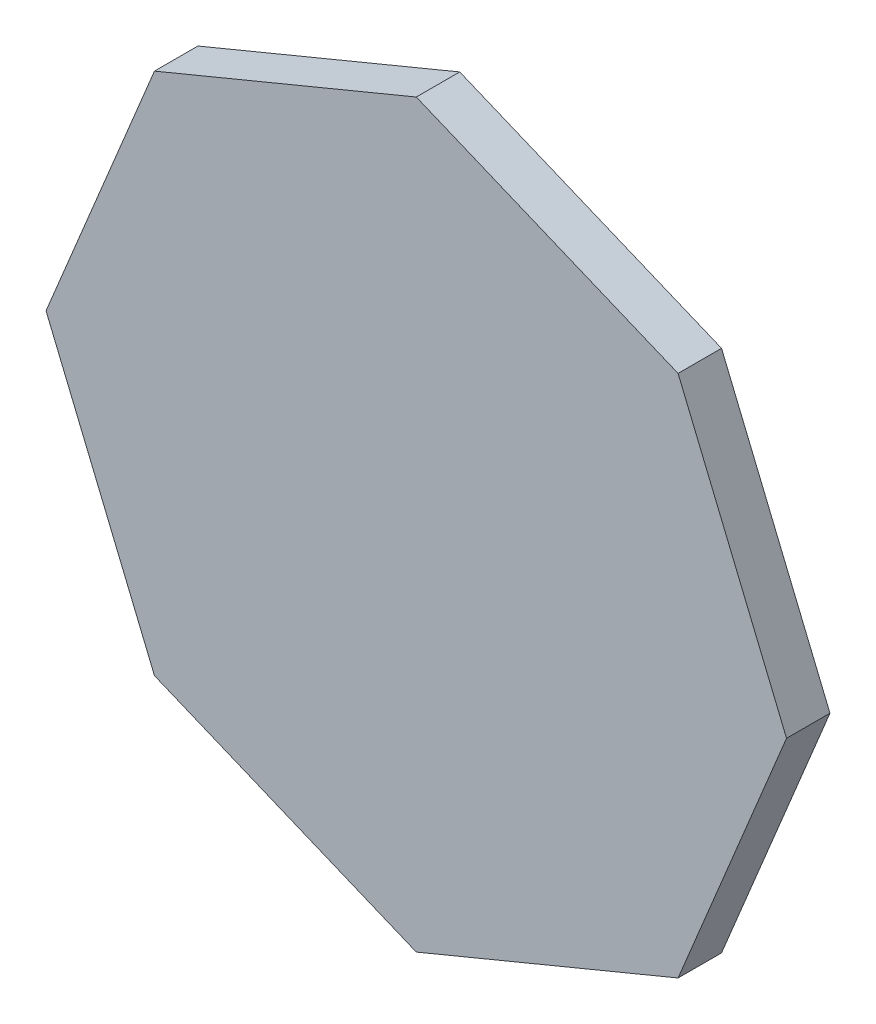
ISO-10303-21;
HEADER;
FILE_DESCRIPTION(('STEP AP214'),'2;1');
FILE_NAME('part.step','',(''),(''),'','','');
FILE_SCHEMA(('AUTOMOTIVE_DESIGN { 1 0 10303 214 1 1 1 1 }'));
ENDSEC;
DATA;
#1=APPLICATION_CONTEXT('core data for automotive mechanical design processes');
#2=APPLICATION_PROTOCOL_DEFINITION('international standard','automotive_design',2000,#1);
#3=PRODUCT_CONTEXT('',#1,'mechanical');
#4=PRODUCT('Part','Part','',(#3));
#5=PRODUCT_RELATED_PRODUCT_CATEGORY('part','',(#4));
#6=PRODUCT_DEFINITION_FORMATION('','',#4);
#7=PRODUCT_DEFINITION_CONTEXT('part definition',#1,'design');
#8=PRODUCT_DEFINITION('design','',#6,#7);
#9=PRODUCT_DEFINITION_SHAPE('','',#8);
#10=(LENGTH_UNIT() NAMED_UNIT(*) SI_UNIT(.MILLI.,.METRE.));
#11=(NAMED_UNIT(*) PLANE_ANGLE_UNIT() SI_UNIT($,.RADIAN.));
#12=(NAMED_UNIT(*) SI_UNIT($,.STERADIAN.) SOLID_ANGLE_UNIT());
#13=UNCERTAINTY_MEASURE_WITH_UNIT(LENGTH_MEASURE(1.E-05),#10,'distance_accuracy_value','');
#14=(GEOMETRIC_REPRESENTATION_CONTEXT(3) GLOBAL_UNCERTAINTY_ASSIGNED_CONTEXT((#13)) GLOBAL_UNIT_ASSIGNED_CONTEXT((#10,
#11,#12)) REPRESENTATION_CONTEXT('',''));
#15=CARTESIAN_POINT('',(0.,0.,0.));
#16=DIRECTION('',(0.,0.,1.));
#17=DIRECTION('',(1.,0.,0.));
#18=AXIS2_PLACEMENT_3D('',#15,#16,#17);
#19=CARTESIAN_POINT('',(0.,0.,0.));
#20=DIRECTION('',(0.,0.,1.));
#21=DIRECTION('',(1.,0.,0.));
#22=AXIS2_PLACEMENT_3D('',#19,#20,#21);
#23=PLANE('',#22);
#24=DIRECTION('',(0.923879532511287,-0.38268343236509,0.));
#25=VECTOR('',#24,1.);
#26=CARTESIAN_POINT('',(135.520462417772,134.43807021748,0.));
#27=LINE('',#26,#25);
#28=CARTESIAN_POINT('',(0.,190.572483729995,0.));
#29=VERTEX_POINT('',#28);
#30=CARTESIAN_POINT('',(134.755095553042,134.755095553042,0.));
#31=VERTEX_POINT('',#30);
#32=EDGE_CURVE('E296',#29,#31,#27,.T.);
#33=ORIENTED_EDGE('',*,*,#32,.T.);
#34=DIRECTION('',(-0.38268343236509,0.923879532511287,0.));
#35=VECTOR('',#34,1.);
#36=CARTESIAN_POINT('',(190.889509065557,-0.765366864730166,0.));
#37=LINE('',#36,#35);
#38=CARTESIAN_POINT('',(190.572483729995,0.,0.));
#39=VERTEX_POINT('',#38);
#40=EDGE_CURVE('E298',#31,#39,#37,.F.);
#41=ORIENTED_EDGE('',*,*,#40,.T.);
#42=DIRECTION('',(0.38268343236509,0.923879532511287,0.));
#43=VECTOR('',#42,1.);
#44=CARTESIAN_POINT('',(134.43807021748,-135.520462417772,0.));
#45=LINE('',#44,#43);
#46=CARTESIAN_POINT('',(134.755095553042,-134.755095553042,0.));
#47=VERTEX_POINT('',#46);
#48=EDGE_CURVE('E284',#39,#47,#45,.F.);
#49=ORIENTED_EDGE('',*,*,#48,.T.);
#50=DIRECTION('',(0.923879532511287,0.38268343236509,0.));
#51=VECTOR('',#50,1.);
#52=CARTESIAN_POINT('',(-0.765366864730152,-190.889509065557,0.));
#53=LINE('',#52,#51);
#54=CARTESIAN_POINT('',(0.,-190.572483729995,0.));
#55=VERTEX_POINT('',#54);
#56=EDGE_CURVE('E286',#47,#55,#53,.F.);
#57=ORIENTED_EDGE('',*,*,#56,.T.);
#58=DIRECTION('',(-0.923879532511287,0.38268343236509,0.));
#59=VECTOR('',#58,1.);
#60=CARTESIAN_POINT('',(-135.520462417772,-134.43807021748,0.));
#61=LINE('',#60,#59);
#62=CARTESIAN_POINT('',(-134.755095553042,-134.755095553042,0.));
#63=VERTEX_POINT('',#62);
#64=EDGE_CURVE('E288',#55,#63,#61,.T.);
#65=ORIENTED_EDGE('',*,*,#64,.T.);
#66=DIRECTION('',(0.38268343236509,-0.923879532511287,0.));
#67=VECTOR('',#66,1.);
#68=CARTESIAN_POINT('',(-190.889509065557,0.765366864730166,0.));
#69=LINE('',#68,#67);
#70=CARTESIAN_POINT('',(-190.572483729995,0.,0.));
#71=VERTEX_POINT('',#70);
#72=EDGE_CURVE('E290',#63,#71,#69,.F.);
#73=ORIENTED_EDGE('',*,*,#72,.T.);
#74=DIRECTION('',(-0.38268343236509,-0.923879532511287,0.));
#75=VECTOR('',#74,1.);
#76=CARTESIAN_POINT('',(-134.43807021748,135.520462417772,0.));
#77=LINE('',#76,#75);
#78=CARTESIAN_POINT('',(-134.755095553042,134.755095553042,0.));
#79=VERTEX_POINT('',#78);
#80=EDGE_CURVE('E292',#71,#79,#77,.F.);
#81=ORIENTED_EDGE('',*,*,#80,.T.);
#82=DIRECTION('',(-0.923879532511287,-0.38268343236509,0.));
#83=VECTOR('',#82,1.);
#84=CARTESIAN_POINT('',(0.76536686473018,190.889509065557,0.));
#85=LINE('',#84,#83);
#86=EDGE_CURVE('E294',#79,#29,#85,.F.);
#87=ORIENTED_EDGE('',*,*,#86,.T.);
#88=EDGE_LOOP('',(#33,#41,#49,#57,#65,#73,#81,#87));
#89=FACE_BOUND('',#88,.T.);
#90=ADVANCED_FACE('F33',(#89),#23,.F.);
#91=CARTESIAN_POINT('',(68.1429146412513,-164.511548706541,0.));
#92=DIRECTION('',(0.38268343236509,-0.923879532511287,0.));
#93=DIRECTION('',(-0.923879532511287,-0.38268343236509,0.));
#94=AXIS2_PLACEMENT_3D('',#91,#92,#93);
#95=PLANE('',#94);
#96=DIRECTION('',(0.,0.,1.));
#97=VECTOR('',#96,1.);
#98=CARTESIAN_POINT('',(0.,-192.737268130579,0.));
#99=LINE('',#98,#97);
#100=CARTESIAN_POINT('',(0.,-192.737268130579,-20.));
#101=VERTEX_POINT('',#100);
#102=CARTESIAN_POINT('',(0.,-192.737268130579,-2.));
#103=VERTEX_POINT('',#102);
#104=EDGE_CURVE('E278',#101,#103,#99,.T.);
#105=ORIENTED_EDGE('',*,*,#104,.T.);
#106=DIRECTION('',(0.923879532511287,0.38268343236509,0.));
#107=VECTOR('',#106,1.);
#108=CARTESIAN_POINT('',(136.285829282503,-136.285829282503,-2.));
#109=LINE('',#108,#107);
#110=CARTESIAN_POINT('',(136.285829282503,-136.285829282503,-2.));
#111=VERTEX_POINT('',#110);
#112=EDGE_CURVE('E42',#103,#111,#109,.T.);
#113=ORIENTED_EDGE('',*,*,#112,.T.);
#114=DIRECTION('',(0.,0.,1.));
#115=VECTOR('',#114,1.);
#116=CARTESIAN_POINT('',(136.285829282503,-136.285829282503,0.));
#117=LINE('',#116,#115);
#118=CARTESIAN_POINT('',(136.285829282503,-136.285829282503,-20.));
#119=VERTEX_POINT('',#118);
#120=EDGE_CURVE('E198',#119,#111,#117,.T.);
#121=ORIENTED_EDGE('',*,*,#120,.F.);
#122=DIRECTION('',(-0.923879532511287,-0.38268343236509,0.));
#123=VECTOR('',#122,1.);
#124=CARTESIAN_POINT('',(-1.14805029709526,-193.212806133923,-20.));
#125=LINE('',#124,#123);
#126=EDGE_CURVE('E197',#119,#101,#125,.T.);
#127=ORIENTED_EDGE('',*,*,#126,.T.);
#128=EDGE_LOOP('',(#105,#113,#121,#127));
#129=FACE_BOUND('',#128,.T.);
#130=ADVANCED_FACE('F384',(#129),#95,.F.);
#131=CARTESIAN_POINT('',(164.511548706541,68.1429146412513,0.));
#132=DIRECTION('',(0.923879532511287,0.38268343236509,0.));
#133=DIRECTION('',(-0.38268343236509,0.923879532511287,0.));
#134=AXIS2_PLACEMENT_3D('',#131,#132,#133);
#135=PLANE('',#134);
#136=DIRECTION('',(0.,0.,-1.));
#137=VECTOR('',#136,1.);
#138=CARTESIAN_POINT('',(192.737268130579,0.,0.));
#139=LINE('',#138,#137);
#140=CARTESIAN_POINT('',(192.737268130579,0.,-2.));
#141=VERTEX_POINT('',#140);
#142=CARTESIAN_POINT('',(192.737268130579,0.,-20.));
#143=VERTEX_POINT('',#142);
#144=EDGE_CURVE('E172',#141,#143,#139,.T.);
#145=ORIENTED_EDGE('',*,*,#144,.F.);
#146=DIRECTION('',(-0.38268343236509,0.923879532511287,0.));
#147=VECTOR('',#146,1.);
#148=CARTESIAN_POINT('',(136.285829282503,136.285829282503,-2.));
#149=LINE('',#148,#147);
#150=CARTESIAN_POINT('',(136.285829282503,136.285829282503,-2.));
#151=VERTEX_POINT('',#150);
#152=EDGE_CURVE('E181',#141,#151,#149,.T.);
#153=ORIENTED_EDGE('',*,*,#152,.T.);
#154=DIRECTION('',(0.,0.,-1.));
#155=VECTOR('',#154,1.);
#156=CARTESIAN_POINT('',(136.285829282503,136.285829282503,0.));
#157=LINE('',#156,#155);
#158=CARTESIAN_POINT('',(136.285829282503,136.285829282503,-20.));
#159=VERTEX_POINT('',#158);
#160=EDGE_CURVE('E182',#151,#159,#157,.T.);
#161=ORIENTED_EDGE('',*,*,#160,.T.);
#162=DIRECTION('',(-0.38268343236509,0.923879532511287,0.));
#163=VECTOR('',#162,1.);
#164=CARTESIAN_POINT('',(135.810291279159,137.433879579598,-20.));
#165=LINE('',#164,#163);
#166=EDGE_CURVE('E185',#143,#159,#165,.T.);
#167=ORIENTED_EDGE('',*,*,#166,.F.);
#168=EDGE_LOOP('',(#145,#153,#161,#167));
#169=FACE_BOUND('',#168,.T.);
#170=ADVANCED_FACE('F186',(#169),#135,.F.);
#171=CARTESIAN_POINT('',(68.1429146412513,164.511548706541,0.));
#172=DIRECTION('',(0.38268343236509,0.923879532511287,0.));
#173=DIRECTION('',(-0.923879532511287,0.38268343236509,0.));
#174=AXIS2_PLACEMENT_3D('',#171,#172,#173);
#175=PLANE('',#174);
#176=ORIENTED_EDGE('',*,*,#160,.F.);
#177=DIRECTION('',(0.923879532511287,-0.38268343236509,0.));
#178=VECTOR('',#177,1.);
#179=CARTESIAN_POINT('',(0.,192.737268130579,-2.));
#180=LINE('',#179,#178);
#181=CARTESIAN_POINT('',(0.,192.737268130579,-2.));
#182=VERTEX_POINT('',#181);
#183=EDGE_CURVE('E301',#151,#182,#180,.F.);
#184=ORIENTED_EDGE('',*,*,#183,.T.);
#185=DIRECTION('',(0.,0.,-1.));
#186=VECTOR('',#185,1.);
#187=CARTESIAN_POINT('',(0.,192.737268130579,0.));
#188=LINE('',#187,#186);
#189=CARTESIAN_POINT('',(0.,192.737268130579,-20.));
#190=VERTEX_POINT('',#189);
#191=EDGE_CURVE('E276',#182,#190,#188,.T.);
#192=ORIENTED_EDGE('',*,*,#191,.T.);
#193=DIRECTION('',(-0.923879532511287,0.38268343236509,0.));
#194=VECTOR('',#193,1.);
#195=CARTESIAN_POINT('',(-1.14805029709526,193.212806133923,-20.));
#196=LINE('',#195,#194);
#197=EDGE_CURVE('E228',#159,#190,#196,.T.);
#198=ORIENTED_EDGE('',*,*,#197,.F.);
#199=EDGE_LOOP('',(#176,#184,#192,#198));
#200=FACE_BOUND('',#199,.T.);
#201=ADVANCED_FACE('F357',(#200),#175,.F.);
#202=CARTESIAN_POINT('',(-68.1429146412513,164.511548706541,0.));
#203=DIRECTION('',(-0.38268343236509,0.923879532511287,0.));
#204=DIRECTION('',(0.923879532511287,0.38268343236509,0.));
#205=AXIS2_PLACEMENT_3D('',#202,#203,#204);
#206=PLANE('',#205);
#207=ORIENTED_EDGE('',*,*,#191,.F.);
#208=DIRECTION('',(-0.923879532511287,-0.38268343236509,0.));
#209=VECTOR('',#208,1.);
#210=CARTESIAN_POINT('',(-136.285829282503,136.285829282503,-2.));
#211=LINE('',#210,#209);
#212=CARTESIAN_POINT('',(-136.285829282503,136.285829282503,-2.));
#213=VERTEX_POINT('',#212);
#214=EDGE_CURVE('E303',#182,#213,#211,.T.);
#215=ORIENTED_EDGE('',*,*,#214,.T.);
#216=DIRECTION('',(0.,0.,1.));
#217=VECTOR('',#216,1.);
#218=CARTESIAN_POINT('',(-136.285829282503,136.285829282503,0.));
#219=LINE('',#218,#217);
#220=CARTESIAN_POINT('',(-136.285829282503,136.285829282503,-20.));
#221=VERTEX_POINT('',#220);
#222=EDGE_CURVE('E210',#221,#213,#219,.T.);
#223=ORIENTED_EDGE('',*,*,#222,.F.);
#224=DIRECTION('',(0.923879532511287,0.38268343236509,0.));
#225=VECTOR('',#224,1.);
#226=CARTESIAN_POINT('',(1.14805029709526,193.212806133923,-20.));
#227=LINE('',#226,#225);
#228=EDGE_CURVE('E233',#221,#190,#227,.T.);
#229=ORIENTED_EDGE('',*,*,#228,.T.);
#230=EDGE_LOOP('',(#207,#215,#223,#229));
#231=FACE_BOUND('',#230,.T.);
#232=ADVANCED_FACE('F362',(#231),#206,.F.);
#233=CARTESIAN_POINT('',(-164.511548706541,-68.1429146412513,0.));
#234=DIRECTION('',(-0.923879532511287,-0.38268343236509,0.));
#235=DIRECTION('',(0.38268343236509,-0.923879532511287,0.));
#236=AXIS2_PLACEMENT_3D('',#233,#234,#235);
#237=PLANE('',#236);
#238=DIRECTION('',(0.,0.,-1.));
#239=VECTOR('',#238,1.);
#240=CARTESIAN_POINT('',(-192.737268130579,0.,0.));
#241=LINE('',#240,#239);
#242=CARTESIAN_POINT('',(-192.737268130579,0.,-2.));
#243=VERTEX_POINT('',#242);
#244=CARTESIAN_POINT('',(-192.737268130579,0.,-20.));
#245=VERTEX_POINT('',#244);
#246=EDGE_CURVE('E280',#243,#245,#241,.T.);
#247=ORIENTED_EDGE('',*,*,#246,.F.);
#248=DIRECTION('',(0.38268343236509,-0.923879532511287,0.));
#249=VECTOR('',#248,1.);
#250=CARTESIAN_POINT('',(-136.285829282503,-136.285829282503,-2.));
#251=LINE('',#250,#249);
#252=CARTESIAN_POINT('',(-136.285829282503,-136.285829282503,-2.));
#253=VERTEX_POINT('',#252);
#254=EDGE_CURVE('E307',#243,#253,#251,.T.);
#255=ORIENTED_EDGE('',*,*,#254,.T.);
#256=DIRECTION('',(0.,0.,-1.));
#257=VECTOR('',#256,1.);
#258=CARTESIAN_POINT('',(-136.285829282503,-136.285829282503,0.));
#259=LINE('',#258,#257);
#260=CARTESIAN_POINT('',(-136.285829282503,-136.285829282503,-20.));
#261=VERTEX_POINT('',#260);
#262=EDGE_CURVE('E219',#253,#261,#259,.T.);
#263=ORIENTED_EDGE('',*,*,#262,.T.);
#264=DIRECTION('',(0.38268343236509,-0.923879532511287,0.));
#265=VECTOR('',#264,1.);
#266=CARTESIAN_POINT('',(-135.810291279159,-137.433879579598,-20.));
#267=LINE('',#266,#265);
#268=EDGE_CURVE('E216',#245,#261,#267,.T.);
#269=ORIENTED_EDGE('',*,*,#268,.F.);
#270=EDGE_LOOP('',(#247,#255,#263,#269));
#271=FACE_BOUND('',#270,.T.);
#272=ADVANCED_FACE('F429',(#271),#237,.F.);
#273=CARTESIAN_POINT('',(-68.1429146412513,-164.511548706541,0.));
#274=DIRECTION('',(-0.38268343236509,-0.923879532511287,0.));
#275=DIRECTION('',(0.923879532511287,-0.38268343236509,0.));
#276=AXIS2_PLACEMENT_3D('',#273,#274,#275);
#277=PLANE('',#276);
#278=ORIENTED_EDGE('',*,*,#262,.F.);
#279=DIRECTION('',(-0.923879532511287,0.38268343236509,0.));
#280=VECTOR('',#279,1.);
#281=CARTESIAN_POINT('',(0.,-192.737268130579,-2.));
#282=LINE('',#281,#280);
#283=EDGE_CURVE('E57',#253,#103,#282,.F.);
#284=ORIENTED_EDGE('',*,*,#283,.T.);
#285=ORIENTED_EDGE('',*,*,#104,.F.);
#286=DIRECTION('',(0.923879532511287,-0.38268343236509,0.));
#287=VECTOR('',#286,1.);
#288=CARTESIAN_POINT('',(1.14805029709526,-193.212806133923,-20.));
#289=LINE('',#288,#287);
#290=EDGE_CURVE('E239',#261,#101,#289,.T.);
#291=ORIENTED_EDGE('',*,*,#290,.F.);
#292=EDGE_LOOP('',(#278,#284,#285,#291));
#293=FACE_BOUND('',#292,.T.);
#294=ADVANCED_FACE('F424',(#293),#277,.F.);
#295=CARTESIAN_POINT('',(0.,-195.984444731457,3.));
#296=DIRECTION('',(-0.38268343236509,0.923879532511287,0.));
#297=DIRECTION('',(-0.923879532511287,-0.38268343236509,0.));
#298=AXIS2_PLACEMENT_3D('',#295,#296,#297);
#299=PLANE('',#298);
#300=DIRECTION('',(0.,0.,-1.));
#301=VECTOR('',#300,1.);
#302=CARTESIAN_POINT('',(0.,-195.984444731457,3.));
#303=LINE('',#302,#301);
#304=CARTESIAN_POINT('',(0.,-195.984444731457,3.));
#305=VERTEX_POINT('',#304);
#306=CARTESIAN_POINT('',(0.,-195.984444731457,-20.));
#307=VERTEX_POINT('',#306);
#308=EDGE_CURVE('E260',#305,#307,#303,.T.);
#309=ORIENTED_EDGE('',*,*,#308,.T.);
#310=DIRECTION('',(-0.923879532511287,-0.38268343236509,0.));
#311=VECTOR('',#310,1.);
#312=CARTESIAN_POINT('',(0.,-195.984444731457,-20.));
#313=LINE('',#312,#311);
#314=CARTESIAN_POINT('',(138.581929876693,-138.581929876693,-20.));
#315=VERTEX_POINT('',#314);
#316=EDGE_CURVE('E223',#315,#307,#313,.T.);
#317=ORIENTED_EDGE('',*,*,#316,.F.);
#318=DIRECTION('',(0.,0.,-1.));
#319=VECTOR('',#318,1.);
#320=CARTESIAN_POINT('',(138.581929876693,-138.581929876693,3.));
#321=LINE('',#320,#319);
#322=CARTESIAN_POINT('',(138.581929876693,-138.581929876693,3.));
#323=VERTEX_POINT('',#322);
#324=EDGE_CURVE('E274',#323,#315,#321,.T.);
#325=ORIENTED_EDGE('',*,*,#324,.F.);
#326=DIRECTION('',(0.923879532511287,0.38268343236509,0.));
#327=VECTOR('',#326,1.);
#328=CARTESIAN_POINT('',(0.,-195.984444731457,3.));
#329=LINE('',#328,#327);
#330=EDGE_CURVE('E241',#305,#323,#329,.T.);
#331=ORIENTED_EDGE('',*,*,#330,.F.);
#332=EDGE_LOOP('',(#309,#317,#325,#331));
#333=FACE_BOUND('',#332,.T.);
#334=ADVANCED_FACE('F421',(#333),#299,.F.);
#335=CARTESIAN_POINT('',(138.581929876693,-138.581929876693,3.));
#336=DIRECTION('',(-0.923879532511287,0.382683432365089,0.));
#337=DIRECTION('',(-0.38268343236509,-0.923879532511287,0.));
#338=AXIS2_PLACEMENT_3D('',#335,#336,#337);
#339=PLANE('',#338);
#340=ORIENTED_EDGE('',*,*,#324,.T.);
#341=DIRECTION('',(-0.38268343236509,-0.923879532511287,0.));
#342=VECTOR('',#341,1.);
#343=CARTESIAN_POINT('',(138.581929876693,-138.581929876693,-20.));
#344=LINE('',#343,#342);
#345=CARTESIAN_POINT('',(195.984444731457,0.,-20.));
#346=VERTEX_POINT('',#345);
#347=EDGE_CURVE('E199',#346,#315,#344,.T.);
#348=ORIENTED_EDGE('',*,*,#347,.F.);
#349=DIRECTION('',(0.,0.,-1.));
#350=VECTOR('',#349,1.);
#351=CARTESIAN_POINT('',(195.984444731457,0.,3.));
#352=LINE('',#351,#350);
#353=CARTESIAN_POINT('',(195.984444731457,0.,3.));
#354=VERTEX_POINT('',#353);
#355=EDGE_CURVE('E272',#354,#346,#352,.T.);
#356=ORIENTED_EDGE('',*,*,#355,.F.);
#357=DIRECTION('',(0.38268343236509,0.923879532511287,0.));
#358=VECTOR('',#357,1.);
#359=CARTESIAN_POINT('',(138.581929876693,-138.581929876693,3.));
#360=LINE('',#359,#358);
#361=EDGE_CURVE('E246',#323,#354,#360,.T.);
#362=ORIENTED_EDGE('',*,*,#361,.F.);
#363=EDGE_LOOP('',(#340,#348,#356,#362));
#364=FACE_BOUND('',#363,.T.);
#365=ADVANCED_FACE('F417',(#364),#339,.F.);
#366=CARTESIAN_POINT('',(195.984444731457,0.,3.));
#367=DIRECTION('',(-0.923879532511287,-0.38268343236509,0.));
#368=DIRECTION('',(0.38268343236509,-0.923879532511287,0.));
#369=AXIS2_PLACEMENT_3D('',#366,#367,#368);
#370=PLANE('',#369);
#371=ORIENTED_EDGE('',*,*,#355,.T.);
#372=DIRECTION('',(-0.38268343236509,0.923879532511287,0.));
#373=VECTOR('',#372,1.);
#374=CARTESIAN_POINT('',(138.581929876693,138.581929876693,-20.));
#375=LINE('',#374,#373);
#376=CARTESIAN_POINT('',(138.581929876693,138.581929876693,-20.));
#377=VERTEX_POINT('',#376);
#378=EDGE_CURVE('E192',#346,#377,#375,.T.);
#379=ORIENTED_EDGE('',*,*,#378,.T.);
#380=DIRECTION('',(0.,0.,-1.));
#381=VECTOR('',#380,1.);
#382=CARTESIAN_POINT('',(138.581929876693,138.581929876693,3.));
#383=LINE('',#382,#381);
#384=CARTESIAN_POINT('',(138.581929876693,138.581929876693,3.));
#385=VERTEX_POINT('',#384);
#386=EDGE_CURVE('E270',#385,#377,#383,.T.);
#387=ORIENTED_EDGE('',*,*,#386,.F.);
#388=DIRECTION('',(-0.38268343236509,0.923879532511287,0.));
#389=VECTOR('',#388,1.);
#390=CARTESIAN_POINT('',(195.984444731457,0.,3.));
#391=LINE('',#390,#389);
#392=EDGE_CURVE('E248',#354,#385,#391,.T.);
#393=ORIENTED_EDGE('',*,*,#392,.F.);
#394=EDGE_LOOP('',(#371,#379,#387,#393));
#395=FACE_BOUND('',#394,.T.);
#396=ADVANCED_FACE('F413',(#395),#370,.F.);
#397=CARTESIAN_POINT('',(138.581929876693,138.581929876693,3.));
#398=DIRECTION('',(-0.382683432365089,-0.923879532511287,0.));
#399=DIRECTION('',(0.923879532511287,-0.38268343236509,0.));
#400=AXIS2_PLACEMENT_3D('',#397,#398,#399);
#401=PLANE('',#400);
#402=ORIENTED_EDGE('',*,*,#386,.T.);
#403=DIRECTION('',(-0.923879532511287,0.38268343236509,0.));
#404=VECTOR('',#403,1.);
#405=CARTESIAN_POINT('',(0.,195.984444731457,-20.));
#406=LINE('',#405,#404);
#407=CARTESIAN_POINT('',(0.,195.984444731457,-20.));
#408=VERTEX_POINT('',#407);
#409=EDGE_CURVE('E225',#377,#408,#406,.T.);
#410=ORIENTED_EDGE('',*,*,#409,.T.);
#411=DIRECTION('',(0.,0.,-1.));
#412=VECTOR('',#411,1.);
#413=CARTESIAN_POINT('',(0.,195.984444731457,3.));
#414=LINE('',#413,#412);
#415=CARTESIAN_POINT('',(0.,195.984444731457,3.));
#416=VERTEX_POINT('',#415);
#417=EDGE_CURVE('E268',#416,#408,#414,.T.);
#418=ORIENTED_EDGE('',*,*,#417,.F.);
#419=DIRECTION('',(-0.923879532511287,0.382683432365089,0.));
#420=VECTOR('',#419,1.);
#421=CARTESIAN_POINT('',(138.581929876693,138.581929876693,3.));
#422=LINE('',#421,#420);
#423=EDGE_CURVE('E250',#385,#416,#422,.T.);
#424=ORIENTED_EDGE('',*,*,#423,.F.);
#425=EDGE_LOOP('',(#402,#410,#418,#424));
#426=FACE_BOUND('',#425,.T.);
#427=ADVANCED_FACE('F409',(#426),#401,.F.);
#428=CARTESIAN_POINT('',(0.,195.984444731457,3.));
#429=DIRECTION('',(0.38268343236509,-0.923879532511287,0.));
#430=DIRECTION('',(0.923879532511287,0.38268343236509,0.));
#431=AXIS2_PLACEMENT_3D('',#428,#429,#430);
#432=PLANE('',#431);
#433=ORIENTED_EDGE('',*,*,#417,.T.);
#434=DIRECTION('',(0.923879532511287,0.38268343236509,0.));
#435=VECTOR('',#434,1.);
#436=CARTESIAN_POINT('',(0.,195.984444731457,-20.));
#437=LINE('',#436,#435);
#438=CARTESIAN_POINT('',(-138.581929876693,138.581929876693,-20.));
#439=VERTEX_POINT('',#438);
#440=EDGE_CURVE('E230',#439,#408,#437,.T.);
#441=ORIENTED_EDGE('',*,*,#440,.F.);
#442=DIRECTION('',(0.,0.,-1.));
#443=VECTOR('',#442,1.);
#444=CARTESIAN_POINT('',(-138.581929876693,138.581929876693,3.));
#445=LINE('',#444,#443);
#446=CARTESIAN_POINT('',(-138.581929876693,138.581929876693,3.));
#447=VERTEX_POINT('',#446);
#448=EDGE_CURVE('E266',#447,#439,#445,.T.);
#449=ORIENTED_EDGE('',*,*,#448,.F.);
#450=DIRECTION('',(-0.923879532511287,-0.38268343236509,0.));
#451=VECTOR('',#450,1.);
#452=CARTESIAN_POINT('',(0.,195.984444731457,3.));
#453=LINE('',#452,#451);
#454=EDGE_CURVE('E252',#416,#447,#453,.T.);
#455=ORIENTED_EDGE('',*,*,#454,.F.);
#456=EDGE_LOOP('',(#433,#441,#449,#455));
#457=FACE_BOUND('',#456,.T.);
#458=ADVANCED_FACE('F405',(#457),#432,.F.);
#459=CARTESIAN_POINT('',(-138.581929876693,138.581929876693,3.));
#460=DIRECTION('',(0.923879532511287,-0.382683432365089,0.));
#461=DIRECTION('',(0.38268343236509,0.923879532511287,0.));
#462=AXIS2_PLACEMENT_3D('',#459,#460,#461);
#463=PLANE('',#462);
#464=ORIENTED_EDGE('',*,*,#448,.T.);
#465=DIRECTION('',(0.38268343236509,0.923879532511287,0.));
#466=VECTOR('',#465,1.);
#467=CARTESIAN_POINT('',(-138.581929876693,138.581929876693,-20.));
#468=LINE('',#467,#466);
#469=CARTESIAN_POINT('',(-195.984444731457,0.,-20.));
#470=VERTEX_POINT('',#469);
#471=EDGE_CURVE('E191',#470,#439,#468,.T.);
#472=ORIENTED_EDGE('',*,*,#471,.F.);
#473=DIRECTION('',(0.,0.,-1.));
#474=VECTOR('',#473,1.);
#475=CARTESIAN_POINT('',(-195.984444731457,0.,3.));
#476=LINE('',#475,#474);
#477=CARTESIAN_POINT('',(-195.984444731457,0.,3.));
#478=VERTEX_POINT('',#477);
#479=EDGE_CURVE('E264',#478,#470,#476,.T.);
#480=ORIENTED_EDGE('',*,*,#479,.F.);
#481=DIRECTION('',(-0.382683432365089,-0.923879532511287,0.));
#482=VECTOR('',#481,1.);
#483=CARTESIAN_POINT('',(-138.581929876693,138.581929876693,3.));
#484=LINE('',#483,#482);
#485=EDGE_CURVE('E254',#447,#478,#484,.T.);
#486=ORIENTED_EDGE('',*,*,#485,.F.);
#487=EDGE_LOOP('',(#464,#472,#480,#486));
#488=FACE_BOUND('',#487,.T.);
#489=ADVANCED_FACE('F401',(#488),#463,.F.);
#490=CARTESIAN_POINT('',(-195.984444731457,0.,3.));
#491=DIRECTION('',(0.923879532511287,0.38268343236509,0.));
#492=DIRECTION('',(-0.38268343236509,0.923879532511287,0.));
#493=AXIS2_PLACEMENT_3D('',#490,#491,#492);
#494=PLANE('',#493);
#495=ORIENTED_EDGE('',*,*,#479,.T.);
#496=DIRECTION('',(0.38268343236509,-0.923879532511287,0.));
#497=VECTOR('',#496,1.);
#498=CARTESIAN_POINT('',(-138.581929876693,-138.581929876693,-20.));
#499=LINE('',#498,#497);
#500=CARTESIAN_POINT('',(-138.581929876693,-138.581929876693,-20.));
#501=VERTEX_POINT('',#500);
#502=EDGE_CURVE('E215',#470,#501,#499,.T.);
#503=ORIENTED_EDGE('',*,*,#502,.T.);
#504=DIRECTION('',(0.,0.,-1.));
#505=VECTOR('',#504,1.);
#506=CARTESIAN_POINT('',(-138.581929876693,-138.581929876693,3.));
#507=LINE('',#506,#505);
#508=CARTESIAN_POINT('',(-138.581929876693,-138.581929876693,3.));
#509=VERTEX_POINT('',#508);
#510=EDGE_CURVE('E262',#509,#501,#507,.T.);
#511=ORIENTED_EDGE('',*,*,#510,.F.);
#512=DIRECTION('',(0.38268343236509,-0.923879532511287,0.));
#513=VECTOR('',#512,1.);
#514=CARTESIAN_POINT('',(-195.984444731457,0.,3.));
#515=LINE('',#514,#513);
#516=EDGE_CURVE('E256',#478,#509,#515,.T.);
#517=ORIENTED_EDGE('',*,*,#516,.F.);
#518=EDGE_LOOP('',(#495,#503,#511,#517));
#519=FACE_BOUND('',#518,.T.);
#520=ADVANCED_FACE('F397',(#519),#494,.F.);
#521=CARTESIAN_POINT('',(-138.581929876693,-138.581929876693,3.));
#522=DIRECTION('',(0.38268343236509,0.923879532511287,0.));
#523=DIRECTION('',(-0.923879532511287,0.38268343236509,0.));
#524=AXIS2_PLACEMENT_3D('',#521,#522,#523);
#525=PLANE('',#524);
#526=ORIENTED_EDGE('',*,*,#510,.T.);
#527=DIRECTION('',(0.923879532511287,-0.38268343236509,0.));
#528=VECTOR('',#527,1.);
#529=CARTESIAN_POINT('',(0.,-195.984444731457,-20.));
#530=LINE('',#529,#528);
#531=EDGE_CURVE('E236',#501,#307,#530,.T.);
#532=ORIENTED_EDGE('',*,*,#531,.T.);
#533=ORIENTED_EDGE('',*,*,#308,.F.);
#534=DIRECTION('',(0.923879532511287,-0.38268343236509,0.));
#535=VECTOR('',#534,1.);
#536=CARTESIAN_POINT('',(-138.581929876693,-138.581929876693,3.));
#537=LINE('',#536,#535);
#538=EDGE_CURVE('E258',#509,#305,#537,.T.);
#539=ORIENTED_EDGE('',*,*,#538,.F.);
#540=EDGE_LOOP('',(#526,#532,#533,#539));
#541=FACE_BOUND('',#540,.T.);
#542=ADVANCED_FACE('F394',(#541),#525,.F.);
#543=CARTESIAN_POINT('',(0.,0.,3.));
#544=DIRECTION('',(0.,0.,1.));
#545=DIRECTION('',(1.,0.,0.));
#546=AXIS2_PLACEMENT_3D('',#543,#544,#545);
#547=PLANE('',#546);
#548=ORIENTED_EDGE('',*,*,#361,.T.);
#549=ORIENTED_EDGE('',*,*,#392,.T.);
#550=ORIENTED_EDGE('',*,*,#423,.T.);
#551=ORIENTED_EDGE('',*,*,#454,.T.);
#552=ORIENTED_EDGE('',*,*,#485,.T.);
#553=ORIENTED_EDGE('',*,*,#516,.T.);
#554=ORIENTED_EDGE('',*,*,#538,.T.);
#555=ORIENTED_EDGE('',*,*,#330,.T.);
#556=EDGE_LOOP('',(#548,#549,#550,#551,#552,#553,#554,#555));
#557=FACE_BOUND('',#556,.T.);
#558=ADVANCED_FACE('F392',(#557),#547,.T.);
#559=CARTESIAN_POINT('',(1.14805029709526,-193.212806133923,-20.));
#560=DIRECTION('',(0.,0.,-1.));
#561=DIRECTION('',(-1.,0.,0.));
#562=AXIS2_PLACEMENT_3D('',#559,#560,#561);
#563=PLANE('',#562);
#564=ORIENTED_EDGE('',*,*,#347,.T.);
#565=ORIENTED_EDGE('',*,*,#316,.T.);
#566=ORIENTED_EDGE('',*,*,#531,.F.);
#567=ORIENTED_EDGE('',*,*,#502,.F.);
#568=ORIENTED_EDGE('',*,*,#471,.T.);
#569=ORIENTED_EDGE('',*,*,#440,.T.);
#570=ORIENTED_EDGE('',*,*,#409,.F.);
#571=ORIENTED_EDGE('',*,*,#378,.F.);
#572=EDGE_LOOP('',(#564,#565,#566,#567,#568,#569,#570,#571));
#573=FACE_BOUND('',#572,.T.);
#574=DIRECTION('',(-0.38268343236509,-0.923879532511287,0.));
#575=VECTOR('',#574,1.);
#576=CARTESIAN_POINT('',(135.810291279159,-137.433879579598,-20.));
#577=LINE('',#576,#575);
#578=EDGE_CURVE('E176',#143,#119,#577,.T.);
#579=ORIENTED_EDGE('',*,*,#578,.F.);
#580=ORIENTED_EDGE('',*,*,#166,.T.);
#581=ORIENTED_EDGE('',*,*,#197,.T.);
#582=ORIENTED_EDGE('',*,*,#228,.F.);
#583=DIRECTION('',(0.38268343236509,0.923879532511287,0.));
#584=VECTOR('',#583,1.);
#585=CARTESIAN_POINT('',(-135.810291279159,137.433879579598,-20.));
#586=LINE('',#585,#584);
#587=EDGE_CURVE('E207',#245,#221,#586,.T.);
#588=ORIENTED_EDGE('',*,*,#587,.F.);
#589=ORIENTED_EDGE('',*,*,#268,.T.);
#590=ORIENTED_EDGE('',*,*,#290,.T.);
#591=ORIENTED_EDGE('',*,*,#126,.F.);
#592=EDGE_LOOP('',(#579,#580,#581,#582,#588,#589,#590,#591));
#593=FACE_BOUND('',#592,.T.);
#594=ADVANCED_FACE('F195',(#573,#593),#563,.T.);
#595=CARTESIAN_POINT('',(-164.511548706541,68.1429146412513,0.));
#596=DIRECTION('',(-0.923879532511287,0.38268343236509,0.));
#597=DIRECTION('',(0.38268343236509,0.923879532511287,0.));
#598=AXIS2_PLACEMENT_3D('',#595,#596,#597);
#599=PLANE('',#598);
#600=ORIENTED_EDGE('',*,*,#222,.T.);
#601=DIRECTION('',(-0.38268343236509,-0.923879532511287,0.));
#602=VECTOR('',#601,1.);
#603=CARTESIAN_POINT('',(-192.737268130579,0.,-2.));
#604=LINE('',#603,#602);
#605=EDGE_CURVE('E305',#213,#243,#604,.T.);
#606=ORIENTED_EDGE('',*,*,#605,.T.);
#607=ORIENTED_EDGE('',*,*,#246,.T.);
#608=ORIENTED_EDGE('',*,*,#587,.T.);
#609=EDGE_LOOP('',(#600,#606,#607,#608));
#610=FACE_BOUND('',#609,.T.);
#611=ADVANCED_FACE('F365',(#610),#599,.F.);
#612=CARTESIAN_POINT('',(164.511548706541,-68.1429146412513,0.));
#613=DIRECTION('',(0.923879532511287,-0.38268343236509,0.));
#614=DIRECTION('',(-0.38268343236509,-0.923879532511287,0.));
#615=AXIS2_PLACEMENT_3D('',#612,#613,#614);
#616=PLANE('',#615);
#617=ORIENTED_EDGE('',*,*,#120,.T.);
#618=DIRECTION('',(0.38268343236509,0.923879532511287,0.));
#619=VECTOR('',#618,1.);
#620=CARTESIAN_POINT('',(192.737268130579,0.,-2.));
#621=LINE('',#620,#619);
#622=EDGE_CURVE('E11',#111,#141,#621,.T.);
#623=ORIENTED_EDGE('',*,*,#622,.T.);
#624=ORIENTED_EDGE('',*,*,#144,.T.);
#625=ORIENTED_EDGE('',*,*,#578,.T.);
#626=EDGE_LOOP('',(#617,#623,#624,#625));
#627=FACE_BOUND('',#626,.T.);
#628=ADVANCED_FACE('F174',(#627),#616,.F.);
#629=CARTESIAN_POINT('',(-162.663789641518,-67.3775477765211,-2.));
#630=DIRECTION('',(-0.38268343236509,0.923879532511287,0.));
#631=DIRECTION('',(-0.923879532511287,-0.38268343236509,0.));
#632=AXIS2_PLACEMENT_3D('',#629,#630,#631);
#633=CYLINDRICAL_SURFACE('',#632,2.);
#634=CARTESIAN_POINT('',(-190.572483729995,0.,-2.));
#635=DIRECTION('',(0.,1.,0.));
#636=DIRECTION('',(1.,0.,0.));
#637=AXIS2_PLACEMENT_3D('',#634,#635,#636);
#638=ELLIPSE('',#637,2.16478440058479,2.);
#639=EDGE_CURVE('E326',#71,#243,#638,.F.);
#640=ORIENTED_EDGE('',*,*,#639,.F.);
#641=ORIENTED_EDGE('',*,*,#72,.F.);
#642=CARTESIAN_POINT('',(-134.755095553042,-134.755095553042,-2.));
#643=DIRECTION('',(-0.707106781186547,0.707106781186547,0.));
#644=DIRECTION('',(0.707106781186548,0.707106781186548,0.));
#645=AXIS2_PLACEMENT_3D('',#642,#643,#644);
#646=ELLIPSE('',#645,2.16478440058479,2.);
#647=EDGE_CURVE('E37',#253,#63,#646,.T.);
#648=ORIENTED_EDGE('',*,*,#647,.F.);
#649=ORIENTED_EDGE('',*,*,#254,.F.);
#650=EDGE_LOOP('',(#640,#641,#648,#649));
#651=FACE_BOUND('',#650,.T.);
#652=ADVANCED_FACE('F35',(#651),#633,.F.);
#653=CARTESIAN_POINT('',(-67.3775477765211,-162.663789641518,-2.));
#654=DIRECTION('',(0.923879532511287,-0.38268343236509,0.));
#655=DIRECTION('',(0.38268343236509,0.923879532511287,0.));
#656=AXIS2_PLACEMENT_3D('',#653,#654,#655);
#657=CYLINDRICAL_SURFACE('',#656,2.);
#658=ORIENTED_EDGE('',*,*,#647,.T.);
#659=ORIENTED_EDGE('',*,*,#64,.F.);
#660=CARTESIAN_POINT('',(0.,-190.572483729995,-2.));
#661=DIRECTION('',(1.,0.,0.));
#662=DIRECTION('',(0.,-1.,0.));
#663=AXIS2_PLACEMENT_3D('',#660,#661,#662);
#664=ELLIPSE('',#663,2.16478440058479,2.);
#665=EDGE_CURVE('E324',#103,#55,#664,.F.);
#666=ORIENTED_EDGE('',*,*,#665,.F.);
#667=ORIENTED_EDGE('',*,*,#283,.F.);
#668=EDGE_LOOP('',(#658,#659,#666,#667));
#669=FACE_BOUND('',#668,.T.);
#670=ADVANCED_FACE('F336',(#669),#657,.F.);
#671=CARTESIAN_POINT('',(-162.663789641518,67.3775477765211,-2.));
#672=DIRECTION('',(0.38268343236509,0.923879532511287,0.));
#673=DIRECTION('',(-0.923879532511287,0.38268343236509,0.));
#674=AXIS2_PLACEMENT_3D('',#671,#672,#673);
#675=CYLINDRICAL_SURFACE('',#674,2.);
#676=ORIENTED_EDGE('',*,*,#639,.T.);
#677=ORIENTED_EDGE('',*,*,#605,.F.);
#678=CARTESIAN_POINT('',(-134.755095553042,134.755095553042,-2.));
#679=DIRECTION('',(0.707106781186547,0.707106781186547,0.));
#680=DIRECTION('',(0.707106781186548,-0.707106781186548,0.));
#681=AXIS2_PLACEMENT_3D('',#678,#679,#680);
#682=ELLIPSE('',#681,2.16478440058479,2.);
#683=EDGE_CURVE('E321',#79,#213,#682,.F.);
#684=ORIENTED_EDGE('',*,*,#683,.F.);
#685=ORIENTED_EDGE('',*,*,#80,.F.);
#686=EDGE_LOOP('',(#676,#677,#684,#685));
#687=FACE_BOUND('',#686,.T.);
#688=ADVANCED_FACE('F367',(#687),#675,.F.);
#689=CARTESIAN_POINT('',(67.3775477765211,-162.663789641518,-2.));
#690=DIRECTION('',(-0.923879532511287,-0.38268343236509,0.));
#691=DIRECTION('',(0.38268343236509,-0.923879532511287,0.));
#692=AXIS2_PLACEMENT_3D('',#689,#690,#691);
#693=CYLINDRICAL_SURFACE('',#692,2.);
#694=ORIENTED_EDGE('',*,*,#665,.T.);
#695=ORIENTED_EDGE('',*,*,#56,.F.);
#696=CARTESIAN_POINT('',(134.755095553042,-134.755095553042,-2.));
#697=DIRECTION('',(-0.707106781186547,-0.707106781186547,0.));
#698=DIRECTION('',(-0.707106781186548,0.707106781186548,0.));
#699=AXIS2_PLACEMENT_3D('',#696,#697,#698);
#700=ELLIPSE('',#699,2.16478440058479,2.);
#701=EDGE_CURVE('E318',#111,#47,#700,.T.);
#702=ORIENTED_EDGE('',*,*,#701,.F.);
#703=ORIENTED_EDGE('',*,*,#112,.F.);
#704=EDGE_LOOP('',(#694,#695,#702,#703));
#705=FACE_BOUND('',#704,.T.);
#706=ADVANCED_FACE('F347',(#705),#693,.F.);
#707=CARTESIAN_POINT('',(-67.3775477765211,162.663789641518,-2.));
#708=DIRECTION('',(0.923879532511287,0.38268343236509,0.));
#709=DIRECTION('',(-0.38268343236509,0.923879532511287,0.));
#710=AXIS2_PLACEMENT_3D('',#707,#708,#709);
#711=CYLINDRICAL_SURFACE('',#710,2.);
#712=ORIENTED_EDGE('',*,*,#683,.T.);
#713=ORIENTED_EDGE('',*,*,#214,.F.);
#714=CARTESIAN_POINT('',(0.,190.572483729995,-2.));
#715=DIRECTION('',(-1.,0.,0.));
#716=DIRECTION('',(0.,1.,0.));
#717=AXIS2_PLACEMENT_3D('',#714,#715,#716);
#718=ELLIPSE('',#717,2.16478440058479,2.);
#719=EDGE_CURVE('E315',#29,#182,#718,.T.);
#720=ORIENTED_EDGE('',*,*,#719,.F.);
#721=ORIENTED_EDGE('',*,*,#86,.F.);
#722=EDGE_LOOP('',(#712,#713,#720,#721));
#723=FACE_BOUND('',#722,.T.);
#724=ADVANCED_FACE('F370',(#723),#711,.F.);
#725=CARTESIAN_POINT('',(162.663789641518,-67.3775477765211,-2.));
#726=DIRECTION('',(-0.38268343236509,-0.923879532511287,0.));
#727=DIRECTION('',(0.923879532511287,-0.38268343236509,0.));
#728=AXIS2_PLACEMENT_3D('',#725,#726,#727);
#729=CYLINDRICAL_SURFACE('',#728,2.);
#730=ORIENTED_EDGE('',*,*,#701,.T.);
#731=ORIENTED_EDGE('',*,*,#48,.F.);
#732=CARTESIAN_POINT('',(190.572483729995,0.,-2.));
#733=DIRECTION('',(0.,-1.,0.));
#734=DIRECTION('',(1.,0.,0.));
#735=AXIS2_PLACEMENT_3D('',#732,#733,#734);
#736=ELLIPSE('',#735,2.16478440058479,2.);
#737=EDGE_CURVE('E313',#141,#39,#736,.T.);
#738=ORIENTED_EDGE('',*,*,#737,.F.);
#739=ORIENTED_EDGE('',*,*,#622,.F.);
#740=EDGE_LOOP('',(#730,#731,#738,#739));
#741=FACE_BOUND('',#740,.T.);
#742=ADVANCED_FACE('F349',(#741),#729,.F.);
#743=CARTESIAN_POINT('',(67.3775477765211,162.663789641518,-2.));
#744=DIRECTION('',(-0.923879532511287,0.38268343236509,0.));
#745=DIRECTION('',(-0.38268343236509,-0.923879532511287,0.));
#746=AXIS2_PLACEMENT_3D('',#743,#744,#745);
#747=CYLINDRICAL_SURFACE('',#746,2.);
#748=ORIENTED_EDGE('',*,*,#719,.T.);
#749=ORIENTED_EDGE('',*,*,#183,.F.);
#750=CARTESIAN_POINT('',(134.755095553042,134.755095553042,-2.));
#751=DIRECTION('',(0.707106781186547,-0.707106781186547,0.));
#752=DIRECTION('',(-0.707106781186548,-0.707106781186548,0.));
#753=AXIS2_PLACEMENT_3D('',#750,#751,#752);
#754=ELLIPSE('',#753,2.16478440058479,2.);
#755=EDGE_CURVE('E311',#31,#151,#754,.F.);
#756=ORIENTED_EDGE('',*,*,#755,.F.);
#757=ORIENTED_EDGE('',*,*,#32,.F.);
#758=EDGE_LOOP('',(#748,#749,#756,#757));
#759=FACE_BOUND('',#758,.T.);
#760=ADVANCED_FACE('F374',(#759),#747,.F.);
#761=CARTESIAN_POINT('',(162.663789641518,67.3775477765211,-2.));
#762=DIRECTION('',(0.38268343236509,-0.923879532511287,0.));
#763=DIRECTION('',(0.923879532511287,0.38268343236509,0.));
#764=AXIS2_PLACEMENT_3D('',#761,#762,#763);
#765=CYLINDRICAL_SURFACE('',#764,2.);
#766=ORIENTED_EDGE('',*,*,#737,.T.);
#767=ORIENTED_EDGE('',*,*,#40,.F.);
#768=ORIENTED_EDGE('',*,*,#755,.T.);
#769=ORIENTED_EDGE('',*,*,#152,.F.);
#770=EDGE_LOOP('',(#766,#767,#768,#769));
#771=FACE_BOUND('',#770,.T.);
#772=ADVANCED_FACE('F353',(#771),#765,.F.);
#773=CLOSED_SHELL('',(#90,#130,#170,#201,#232,#272,#294,#334,#365,#396,#427,#458,#489,#520,#542,
#558,#594,#611,#628,#652,#670,#688,#706,#724,#742,#760,#772));
#774=MANIFOLD_SOLID_BREP('B2',#773);
#775=ADVANCED_BREP_SHAPE_REPRESENTATION('',(#18,#774),#14);
#776=SHAPE_DEFINITION_REPRESENTATION(#9,#775);
ENDSEC;
END-ISO-10303-21;
